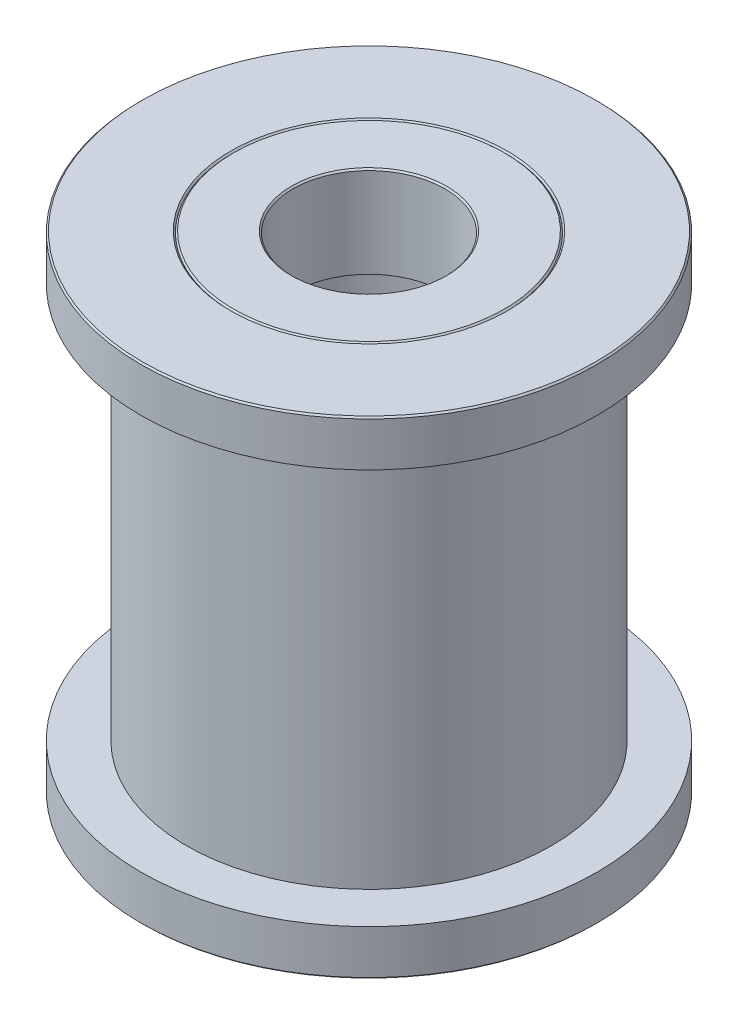
ISO-10303-21;
HEADER;
FILE_DESCRIPTION(('STEP AP214'),'2;1');
FILE_NAME('part.step','',(''),(''),'','','');
FILE_SCHEMA(('AUTOMOTIVE_DESIGN { 1 0 10303 214 1 1 1 1 }'));
ENDSEC;
DATA;
#1=APPLICATION_CONTEXT('core data for automotive mechanical design processes');
#2=APPLICATION_PROTOCOL_DEFINITION('international standard','automotive_design',2000,#1);
#3=PRODUCT_CONTEXT('',#1,'mechanical');
#4=PRODUCT('Part','Part','',(#3));
#5=PRODUCT_RELATED_PRODUCT_CATEGORY('part','',(#4));
#6=PRODUCT_DEFINITION_FORMATION('','',#4);
#7=PRODUCT_DEFINITION_CONTEXT('part definition',#1,'design');
#8=PRODUCT_DEFINITION('design','',#6,#7);
#9=PRODUCT_DEFINITION_SHAPE('','',#8);
#10=(LENGTH_UNIT() NAMED_UNIT(*) SI_UNIT(.MILLI.,.METRE.));
#11=(NAMED_UNIT(*) PLANE_ANGLE_UNIT() SI_UNIT($,.RADIAN.));
#12=(NAMED_UNIT(*) SI_UNIT($,.STERADIAN.) SOLID_ANGLE_UNIT());
#13=UNCERTAINTY_MEASURE_WITH_UNIT(LENGTH_MEASURE(1.E-05),#10,'distance_accuracy_value','');
#14=(GEOMETRIC_REPRESENTATION_CONTEXT(3) GLOBAL_UNCERTAINTY_ASSIGNED_CONTEXT((#13)) GLOBAL_UNIT_ASSIGNED_CONTEXT((#10,
#11,#12)) REPRESENTATION_CONTEXT('',''));
#15=CARTESIAN_POINT('',(0.,0.,0.));
#16=DIRECTION('',(0.,0.,1.));
#17=DIRECTION('',(1.,0.,0.));
#18=AXIS2_PLACEMENT_3D('',#15,#16,#17);
#19=CARTESIAN_POINT('',(0.,-5.57580398162329,0.));
#20=DIRECTION('',(0.,1.,0.));
#21=DIRECTION('',(-1.,0.,0.));
#22=AXIS2_PLACEMENT_3D('',#19,#20,#21);
#23=PLANE('',#22);
#24=CARTESIAN_POINT('',(0.,-5.57580398162329,0.));
#25=DIRECTION('',(0.,-1.,0.));
#26=DIRECTION('',(1.,0.,0.));
#27=AXIS2_PLACEMENT_3D('',#24,#25,#26);
#28=CIRCLE('',#27,2.49999999999996);
#29=CARTESIAN_POINT('',(2.49999999999998,-5.57580398162328,0.));
#30=VERTEX_POINT('',#29);
#31=EDGE_CURVE('E63',#30,#30,#28,.T.);
#32=ORIENTED_EDGE('',*,*,#31,.T.);
#33=EDGE_LOOP('',(#32));
#34=FACE_BOUND('',#33,.T.);
#35=CARTESIAN_POINT('',(0.,-5.57580398162329,0.));
#36=DIRECTION('',(0.,-1.,0.));
#37=DIRECTION('',(1.,0.,0.));
#38=AXIS2_PLACEMENT_3D('',#35,#36,#37);
#39=CIRCLE('',#38,4.49999999999998);
#40=CARTESIAN_POINT('',(4.5,-5.57580398162328,0.));
#41=VERTEX_POINT('',#40);
#42=EDGE_CURVE('E66',#41,#41,#39,.T.);
#43=ORIENTED_EDGE('',*,*,#42,.F.);
#44=EDGE_LOOP('',(#43));
#45=FACE_BOUND('',#44,.T.);
#46=ADVANCED_FACE('F43',(#34,#45),#23,.T.);
#47=CARTESIAN_POINT('',(0.,-12.8882082695253,0.));
#48=DIRECTION('',(0.,-1.,0.));
#49=DIRECTION('',(1.,0.,0.));
#50=AXIS2_PLACEMENT_3D('',#47,#48,#49);
#51=CYLINDRICAL_SURFACE('',#50,2.49999999999995);
#52=CARTESIAN_POINT('',(0.,-8.52580398162329,0.));
#53=DIRECTION('',(0.,1.,0.));
#54=DIRECTION('',(-1.,0.,0.));
#55=AXIS2_PLACEMENT_3D('',#52,#53,#54);
#56=CIRCLE('',#55,2.49999999999995);
#57=CARTESIAN_POINT('',(-2.49999999999992,-8.5258039816233,0.));
#58=VERTEX_POINT('',#57);
#59=EDGE_CURVE('E11',#58,#58,#56,.F.);
#60=ORIENTED_EDGE('',*,*,#59,.T.);
#61=EDGE_LOOP('',(#60));
#62=FACE_BOUND('',#61,.T.);
#63=ORIENTED_EDGE('',*,*,#31,.F.);
#64=EDGE_LOOP('',(#63));
#65=FACE_BOUND('',#64,.T.);
#66=ADVANCED_FACE('F73',(#62,#65),#51,.F.);
#67=CARTESIAN_POINT('',(0.,-8.57580398162329,0.));
#68=DIRECTION('',(0.,1.,0.));
#69=DIRECTION('',(-1.,0.,0.));
#70=AXIS2_PLACEMENT_3D('',#67,#68,#69);
#71=PLANE('',#70);
#72=CARTESIAN_POINT('',(0.,-8.57580398162329,0.));
#73=DIRECTION('',(0.,1.,0.));
#74=DIRECTION('',(-1.,0.,0.));
#75=AXIS2_PLACEMENT_3D('',#72,#73,#74);
#76=CIRCLE('',#75,4.44999999999998);
#77=CARTESIAN_POINT('',(-4.44999999999995,-8.57580398162331,0.));
#78=VERTEX_POINT('',#77);
#79=EDGE_CURVE('E54',#78,#78,#76,.F.);
#80=ORIENTED_EDGE('',*,*,#79,.T.);
#81=EDGE_LOOP('',(#80));
#82=FACE_BOUND('',#81,.T.);
#83=CARTESIAN_POINT('',(0.,-8.57580398162329,0.));
#84=DIRECTION('',(0.,1.,0.));
#85=DIRECTION('',(-1.,0.,0.));
#86=AXIS2_PLACEMENT_3D('',#83,#84,#85);
#87=CIRCLE('',#86,2.54999999999995);
#88=CARTESIAN_POINT('',(-2.54999999999992,-8.5758039816233,0.));
#89=VERTEX_POINT('',#88);
#90=EDGE_CURVE('E58',#89,#89,#87,.T.);
#91=ORIENTED_EDGE('',*,*,#90,.T.);
#92=EDGE_LOOP('',(#91));
#93=FACE_BOUND('',#92,.T.);
#94=ADVANCED_FACE('F79',(#82,#93),#71,.F.);
#95=CARTESIAN_POINT('',(0.,-12.8882082695253,0.));
#96=DIRECTION('',(0.,-1.,0.));
#97=DIRECTION('',(1.,0.,0.));
#98=AXIS2_PLACEMENT_3D('',#95,#96,#97);
#99=CYLINDRICAL_SURFACE('',#98,4.49999999999998);
#100=CARTESIAN_POINT('',(0.,-8.52580398162329,0.));
#101=DIRECTION('',(0.,1.,0.));
#102=DIRECTION('',(-1.,0.,0.));
#103=AXIS2_PLACEMENT_3D('',#100,#101,#102);
#104=CIRCLE('',#103,4.49999999999998);
#105=CARTESIAN_POINT('',(-4.49999999999995,-8.52580398162331,0.));
#106=VERTEX_POINT('',#105);
#107=EDGE_CURVE('E50',#106,#106,#104,.T.);
#108=ORIENTED_EDGE('',*,*,#107,.T.);
#109=EDGE_LOOP('',(#108));
#110=FACE_BOUND('',#109,.T.);
#111=ORIENTED_EDGE('',*,*,#42,.T.);
#112=EDGE_LOOP('',(#111));
#113=FACE_BOUND('',#112,.T.);
#114=ADVANCED_FACE('F70',(#110,#113),#99,.T.);
#115=CARTESIAN_POINT('',(0.,-8.57580398162329,0.));
#116=DIRECTION('',(0.,1.,0.));
#117=DIRECTION('',(-1.,0.,0.));
#118=AXIS2_PLACEMENT_3D('',#115,#116,#117);
#119=CONICAL_SURFACE('',#118,4.44999999999998,0.78539816339744);
#120=ORIENTED_EDGE('',*,*,#107,.F.);
#121=EDGE_LOOP('',(#120));
#122=FACE_BOUND('',#121,.T.);
#123=ORIENTED_EDGE('',*,*,#79,.F.);
#124=EDGE_LOOP('',(#123));
#125=FACE_BOUND('',#124,.T.);
#126=ADVANCED_FACE('F82',(#122,#125),#119,.T.);
#127=CARTESIAN_POINT('',(0.,-8.52580398162329,0.));
#128=DIRECTION('',(0.,-1.,0.));
#129=DIRECTION('',(1.,0.,0.));
#130=AXIS2_PLACEMENT_3D('',#127,#128,#129);
#131=CONICAL_SURFACE('',#130,2.49999999999995,0.785398163397444);
#132=ORIENTED_EDGE('',*,*,#90,.F.);
#133=EDGE_LOOP('',(#132));
#134=FACE_BOUND('',#133,.T.);
#135=ORIENTED_EDGE('',*,*,#59,.F.);
#136=EDGE_LOOP('',(#135));
#137=FACE_BOUND('',#136,.T.);
#138=ADVANCED_FACE('F45',(#134,#137),#131,.F.);
#139=CLOSED_SHELL('',(#46,#66,#94,#114,#126,#138));
#140=MANIFOLD_SOLID_BREP('B2',#139);
#141=CARTESIAN_POINT('',(0.,-12.8882082695253,0.));
#142=DIRECTION('',(0.,-1.,0.));
#143=DIRECTION('',(1.,0.,0.));
#144=AXIS2_PLACEMENT_3D('',#141,#142,#143);
#145=CYLINDRICAL_SURFACE('',#144,2.50000000000002);
#146=CARTESIAN_POINT('',(0.,7.37419601837671,0.));
#147=DIRECTION('',(0.,1.,0.));
#148=DIRECTION('',(-1.,0.,0.));
#149=AXIS2_PLACEMENT_3D('',#146,#147,#148);
#150=CIRCLE('',#149,2.50000000000002);
#151=CARTESIAN_POINT('',(-2.50000000000004,7.3741960183767,0.));
#152=VERTEX_POINT('',#151);
#153=EDGE_CURVE('E42',#152,#152,#150,.T.);
#154=ORIENTED_EDGE('',*,*,#153,.T.);
#155=EDGE_LOOP('',(#154));
#156=FACE_BOUND('',#155,.T.);
#157=CARTESIAN_POINT('',(0.,4.42419601837671,0.));
#158=DIRECTION('',(0.,-1.,0.));
#159=DIRECTION('',(1.,0.,0.));
#160=AXIS2_PLACEMENT_3D('',#157,#158,#159);
#161=CIRCLE('',#160,2.50000000000001);
#162=CARTESIAN_POINT('',(2.5,4.42419601837672,0.));
#163=VERTEX_POINT('',#162);
#164=EDGE_CURVE('E167',#163,#163,#161,.T.);
#165=ORIENTED_EDGE('',*,*,#164,.T.);
#166=EDGE_LOOP('',(#165));
#167=FACE_BOUND('',#166,.T.);
#168=ADVANCED_FACE('F147',(#156,#167),#145,.F.);
#169=CARTESIAN_POINT('',(0.,4.42419601837671,0.));
#170=DIRECTION('',(0.,1.,0.));
#171=DIRECTION('',(-1.,0.,0.));
#172=AXIS2_PLACEMENT_3D('',#169,#170,#171);
#173=PLANE('',#172);
#174=ORIENTED_EDGE('',*,*,#164,.F.);
#175=EDGE_LOOP('',(#174));
#176=FACE_BOUND('',#175,.T.);
#177=CARTESIAN_POINT('',(0.,4.4241960183767,0.));
#178=DIRECTION('',(0.,-1.,0.));
#179=DIRECTION('',(1.,0.,0.));
#180=AXIS2_PLACEMENT_3D('',#177,#178,#179);
#181=CIRCLE('',#180,4.50000000000002);
#182=CARTESIAN_POINT('',(4.5,4.42419601837672,0.));
#183=VERTEX_POINT('',#182);
#184=EDGE_CURVE('E170',#183,#183,#181,.T.);
#185=ORIENTED_EDGE('',*,*,#184,.T.);
#186=EDGE_LOOP('',(#185));
#187=FACE_BOUND('',#186,.T.);
#188=ADVANCED_FACE('F174',(#176,#187),#173,.F.);
#189=CARTESIAN_POINT('',(0.,-12.8882082695253,0.));
#190=DIRECTION('',(0.,-1.,0.));
#191=DIRECTION('',(1.,0.,0.));
#192=AXIS2_PLACEMENT_3D('',#189,#190,#191);
#193=CYLINDRICAL_SURFACE('',#192,4.50000000000002);
#194=CARTESIAN_POINT('',(0.,7.37419601837671,0.));
#195=DIRECTION('',(0.,1.,0.));
#196=DIRECTION('',(-1.,0.,0.));
#197=AXIS2_PLACEMENT_3D('',#194,#195,#196);
#198=CIRCLE('',#197,4.50000000000002);
#199=CARTESIAN_POINT('',(-4.50000000000005,7.3741960183767,0.));
#200=VERTEX_POINT('',#199);
#201=EDGE_CURVE('E162',#200,#200,#198,.F.);
#202=ORIENTED_EDGE('',*,*,#201,.T.);
#203=EDGE_LOOP('',(#202));
#204=FACE_BOUND('',#203,.T.);
#205=ORIENTED_EDGE('',*,*,#184,.F.);
#206=EDGE_LOOP('',(#205));
#207=FACE_BOUND('',#206,.T.);
#208=ADVANCED_FACE('F176',(#204,#207),#193,.T.);
#209=CARTESIAN_POINT('',(0.,7.42419601837671,0.));
#210=DIRECTION('',(0.,1.,0.));
#211=DIRECTION('',(-1.,0.,0.));
#212=AXIS2_PLACEMENT_3D('',#209,#210,#211);
#213=PLANE('',#212);
#214=CARTESIAN_POINT('',(0.,7.42419601837671,0.));
#215=DIRECTION('',(0.,1.,0.));
#216=DIRECTION('',(-1.,0.,0.));
#217=AXIS2_PLACEMENT_3D('',#214,#215,#216);
#218=CIRCLE('',#217,4.45000000000002);
#219=CARTESIAN_POINT('',(-4.45000000000005,7.42419601837669,0.));
#220=VERTEX_POINT('',#219);
#221=EDGE_CURVE('E154',#220,#220,#218,.T.);
#222=ORIENTED_EDGE('',*,*,#221,.T.);
#223=EDGE_LOOP('',(#222));
#224=FACE_BOUND('',#223,.T.);
#225=CARTESIAN_POINT('',(0.,7.42419601837671,0.));
#226=DIRECTION('',(0.,1.,0.));
#227=DIRECTION('',(-1.,0.,0.));
#228=AXIS2_PLACEMENT_3D('',#225,#226,#227);
#229=CIRCLE('',#228,2.55000000000002);
#230=CARTESIAN_POINT('',(-2.55000000000004,7.4241960183767,0.));
#231=VERTEX_POINT('',#230);
#232=EDGE_CURVE('E158',#231,#231,#229,.F.);
#233=ORIENTED_EDGE('',*,*,#232,.T.);
#234=EDGE_LOOP('',(#233));
#235=FACE_BOUND('',#234,.T.);
#236=ADVANCED_FACE('F178',(#224,#235),#213,.T.);
#237=CARTESIAN_POINT('',(0.,7.37419601837671,0.));
#238=DIRECTION('',(0.,-1.,0.));
#239=DIRECTION('',(1.,0.,0.));
#240=AXIS2_PLACEMENT_3D('',#237,#238,#239);
#241=CONICAL_SURFACE('',#240,4.50000000000002,0.785398163397457);
#242=ORIENTED_EDGE('',*,*,#221,.F.);
#243=EDGE_LOOP('',(#242));
#244=FACE_BOUND('',#243,.T.);
#245=ORIENTED_EDGE('',*,*,#201,.F.);
#246=EDGE_LOOP('',(#245));
#247=FACE_BOUND('',#246,.T.);
#248=ADVANCED_FACE('F185',(#244,#247),#241,.T.);
#249=CARTESIAN_POINT('',(0.,7.42419601837671,0.));
#250=DIRECTION('',(0.,1.,0.));
#251=DIRECTION('',(-1.,0.,0.));
#252=AXIS2_PLACEMENT_3D('',#249,#250,#251);
#253=CONICAL_SURFACE('',#252,2.55000000000002,0.785398163397427);
#254=ORIENTED_EDGE('',*,*,#153,.F.);
#255=EDGE_LOOP('',(#254));
#256=FACE_BOUND('',#255,.T.);
#257=ORIENTED_EDGE('',*,*,#232,.F.);
#258=EDGE_LOOP('',(#257));
#259=FACE_BOUND('',#258,.T.);
#260=ADVANCED_FACE('F149',(#256,#259),#253,.F.);
#261=CLOSED_SHELL('',(#168,#188,#208,#236,#248,#260));
#262=MANIFOLD_SOLID_BREP('B6',#261);
#263=CARTESIAN_POINT('',(0.,-12.8882082695253,0.));
#264=DIRECTION('',(0.,-1.,0.));
#265=DIRECTION('',(1.,0.,0.));
#266=AXIS2_PLACEMENT_3D('',#263,#264,#265);
#267=CYLINDRICAL_SURFACE('',#266,4.49999999999998);
#268=CARTESIAN_POINT('',(0.,-8.5258039816233,0.));
#269=DIRECTION('',(0.,-1.,0.));
#270=DIRECTION('',(1.,0.,0.));
#271=AXIS2_PLACEMENT_3D('',#268,#269,#270);
#272=CIRCLE('',#271,4.49999999999998);
#273=CARTESIAN_POINT('',(4.50000000000001,-8.52580398162329,0.));
#274=VERTEX_POINT('',#273);
#275=EDGE_CURVE('E259',#274,#274,#272,.T.);
#276=ORIENTED_EDGE('',*,*,#275,.T.);
#277=EDGE_LOOP('',(#276));
#278=FACE_BOUND('',#277,.T.);
#279=CARTESIAN_POINT('',(0.,-5.57580398162329,0.));
#280=DIRECTION('',(0.,-1.,0.));
#281=DIRECTION('',(1.,0.,0.));
#282=AXIS2_PLACEMENT_3D('',#279,#280,#281);
#283=CIRCLE('',#282,4.49999999999998);
#284=CARTESIAN_POINT('',(4.5,-5.57580398162328,0.));
#285=VERTEX_POINT('',#284);
#286=EDGE_CURVE('E297',#285,#285,#283,.T.);
#287=ORIENTED_EDGE('',*,*,#286,.F.);
#288=EDGE_LOOP('',(#287));
#289=FACE_BOUND('',#288,.T.);
#290=ADVANCED_FACE('F244',(#278,#289),#267,.F.);
#291=CARTESIAN_POINT('',(0.,-8.5758039816233,0.));
#292=DIRECTION('',(0.,-1.,0.));
#293=DIRECTION('',(1.,0.,0.));
#294=AXIS2_PLACEMENT_3D('',#291,#292,#293);
#295=PLANE('',#294);
#296=CARTESIAN_POINT('',(0.,-8.5758039816233,0.));
#297=DIRECTION('',(0.,-1.,0.));
#298=DIRECTION('',(1.,0.,0.));
#299=AXIS2_PLACEMENT_3D('',#296,#297,#298);
#300=CIRCLE('',#299,4.54999999999998);
#301=CARTESIAN_POINT('',(4.55000000000001,-8.57580398162328,0.));
#302=VERTEX_POINT('',#301);
#303=EDGE_CURVE('E251',#302,#302,#300,.F.);
#304=ORIENTED_EDGE('',*,*,#303,.T.);
#305=EDGE_LOOP('',(#304));
#306=FACE_BOUND('',#305,.T.);
#307=CARTESIAN_POINT('',(0.,-8.5758039816233,0.));
#308=DIRECTION('',(0.,-1.,0.));
#309=DIRECTION('',(1.,0.,0.));
#310=AXIS2_PLACEMENT_3D('',#307,#308,#309);
#311=CIRCLE('',#310,7.44999999999998);
#312=CARTESIAN_POINT('',(7.45000000000001,-8.57580398162327,0.));
#313=VERTEX_POINT('',#312);
#314=EDGE_CURVE('E255',#313,#313,#311,.T.);
#315=ORIENTED_EDGE('',*,*,#314,.T.);
#316=EDGE_LOOP('',(#315));
#317=FACE_BOUND('',#316,.T.);
#318=ADVANCED_FACE('F305',(#306,#317),#295,.T.);
#319=CARTESIAN_POINT('',(0.,-12.8882082695253,0.));
#320=DIRECTION('',(0.,-1.,0.));
#321=DIRECTION('',(1.,0.,0.));
#322=AXIS2_PLACEMENT_3D('',#319,#320,#321);
#323=CYLINDRICAL_SURFACE('',#322,7.49999999999997);
#324=CARTESIAN_POINT('',(0.,-8.52580398162331,0.));
#325=DIRECTION('',(0.,-1.,0.));
#326=DIRECTION('',(1.,0.,0.));
#327=AXIS2_PLACEMENT_3D('',#324,#325,#326);
#328=CIRCLE('',#327,7.49999999999997);
#329=CARTESIAN_POINT('',(7.5,-8.52580398162328,0.));
#330=VERTEX_POINT('',#329);
#331=EDGE_CURVE('E146',#330,#330,#328,.F.);
#332=ORIENTED_EDGE('',*,*,#331,.T.);
#333=EDGE_LOOP('',(#332));
#334=FACE_BOUND('',#333,.T.);
#335=CARTESIAN_POINT('',(0.,-7.07580398162331,0.));
#336=DIRECTION('',(0.,-1.,0.));
#337=DIRECTION('',(1.,0.,0.));
#338=AXIS2_PLACEMENT_3D('',#335,#336,#337);
#339=CIRCLE('',#338,7.49999999999997);
#340=CARTESIAN_POINT('',(7.5,-7.07580398162328,0.));
#341=VERTEX_POINT('',#340);
#342=EDGE_CURVE('E276',#341,#341,#339,.T.);
#343=ORIENTED_EDGE('',*,*,#342,.T.);
#344=EDGE_LOOP('',(#343));
#345=FACE_BOUND('',#344,.T.);
#346=ADVANCED_FACE('F311',(#334,#345),#323,.T.);
#347=CARTESIAN_POINT('',(0.,-7.0758039816233,0.));
#348=DIRECTION('',(0.,-1.,0.));
#349=DIRECTION('',(1.,0.,0.));
#350=AXIS2_PLACEMENT_3D('',#347,#348,#349);
#351=PLANE('',#350);
#352=ORIENTED_EDGE('',*,*,#342,.F.);
#353=EDGE_LOOP('',(#352));
#354=FACE_BOUND('',#353,.T.);
#355=CARTESIAN_POINT('',(0.,-7.0758039816233,0.));
#356=DIRECTION('',(0.,-1.,0.));
#357=DIRECTION('',(1.,0.,0.));
#358=AXIS2_PLACEMENT_3D('',#355,#356,#357);
#359=CIRCLE('',#358,5.99999999999998);
#360=CARTESIAN_POINT('',(6.,-7.07580398162328,0.));
#361=VERTEX_POINT('',#360);
#362=EDGE_CURVE('E279',#361,#361,#359,.T.);
#363=ORIENTED_EDGE('',*,*,#362,.T.);
#364=EDGE_LOOP('',(#363));
#365=FACE_BOUND('',#364,.T.);
#366=ADVANCED_FACE('F400',(#354,#365),#351,.F.);
#367=CARTESIAN_POINT('',(0.,-12.8882082695253,0.));
#368=DIRECTION('',(0.,-1.,0.));
#369=DIRECTION('',(1.,0.,0.));
#370=AXIS2_PLACEMENT_3D('',#367,#368,#369);
#371=CYLINDRICAL_SURFACE('',#370,6.);
#372=CARTESIAN_POINT('',(0.,5.9241960183767,0.));
#373=DIRECTION('',(0.,-1.,0.));
#374=DIRECTION('',(1.,0.,0.));
#375=AXIS2_PLACEMENT_3D('',#372,#373,#374);
#376=CIRCLE('',#375,6.00000000000002);
#377=CARTESIAN_POINT('',(6.,5.92419601837672,0.));
#378=VERTEX_POINT('',#377);
#379=EDGE_CURVE('E282',#378,#378,#376,.T.);
#380=ORIENTED_EDGE('',*,*,#379,.T.);
#381=EDGE_LOOP('',(#380));
#382=FACE_BOUND('',#381,.T.);
#383=ORIENTED_EDGE('',*,*,#362,.F.);
#384=EDGE_LOOP('',(#383));
#385=FACE_BOUND('',#384,.T.);
#386=ADVANCED_FACE('F444',(#382,#385),#371,.T.);
#387=CARTESIAN_POINT('',(0.,5.9241960183767,0.));
#388=DIRECTION('',(0.,-1.,0.));
#389=DIRECTION('',(1.,0.,0.));
#390=AXIS2_PLACEMENT_3D('',#387,#388,#389);
#391=PLANE('',#390);
#392=CARTESIAN_POINT('',(0.,5.92419601837669,0.));
#393=DIRECTION('',(0.,-1.,0.));
#394=DIRECTION('',(1.,0.,0.));
#395=AXIS2_PLACEMENT_3D('',#392,#393,#394);
#396=CIRCLE('',#395,7.50000000000002);
#397=CARTESIAN_POINT('',(7.5,5.92419601837672,0.));
#398=VERTEX_POINT('',#397);
#399=EDGE_CURVE('E285',#398,#398,#396,.T.);
#400=ORIENTED_EDGE('',*,*,#399,.T.);
#401=EDGE_LOOP('',(#400));
#402=FACE_BOUND('',#401,.T.);
#403=ORIENTED_EDGE('',*,*,#379,.F.);
#404=EDGE_LOOP('',(#403));
#405=FACE_BOUND('',#404,.T.);
#406=ADVANCED_FACE('F388',(#402,#405),#391,.T.);
#407=CARTESIAN_POINT('',(0.,-12.8882082695253,0.));
#408=DIRECTION('',(0.,-1.,0.));
#409=DIRECTION('',(1.,0.,0.));
#410=AXIS2_PLACEMENT_3D('',#407,#408,#409);
#411=CYLINDRICAL_SURFACE('',#410,7.50000000000002);
#412=CARTESIAN_POINT('',(0.,7.3741960183767,0.));
#413=DIRECTION('',(0.,-1.,0.));
#414=DIRECTION('',(1.,0.,0.));
#415=AXIS2_PLACEMENT_3D('',#412,#413,#414);
#416=CIRCLE('',#415,7.50000000000002);
#417=CARTESIAN_POINT('',(7.5,7.37419601837673,0.));
#418=VERTEX_POINT('',#417);
#419=EDGE_CURVE('E264',#418,#418,#416,.T.);
#420=ORIENTED_EDGE('',*,*,#419,.T.);
#421=EDGE_LOOP('',(#420));
#422=FACE_BOUND('',#421,.T.);
#423=ORIENTED_EDGE('',*,*,#399,.F.);
#424=EDGE_LOOP('',(#423));
#425=FACE_BOUND('',#424,.T.);
#426=ADVANCED_FACE('F378',(#422,#425),#411,.T.);
#427=CARTESIAN_POINT('',(0.,7.4241960183767,0.));
#428=DIRECTION('',(0.,-1.,0.));
#429=DIRECTION('',(1.,0.,0.));
#430=AXIS2_PLACEMENT_3D('',#427,#428,#429);
#431=PLANE('',#430);
#432=CARTESIAN_POINT('',(0.,7.4241960183767,0.));
#433=DIRECTION('',(0.,-1.,0.));
#434=DIRECTION('',(1.,0.,0.));
#435=AXIS2_PLACEMENT_3D('',#432,#433,#434);
#436=CIRCLE('',#435,4.55000000000002);
#437=CARTESIAN_POINT('',(4.55,7.42419601837672,0.));
#438=VERTEX_POINT('',#437);
#439=EDGE_CURVE('E270',#438,#438,#436,.T.);
#440=ORIENTED_EDGE('',*,*,#439,.T.);
#441=EDGE_LOOP('',(#440));
#442=FACE_BOUND('',#441,.T.);
#443=CARTESIAN_POINT('',(0.,7.4241960183767,0.));
#444=DIRECTION('',(0.,-1.,0.));
#445=DIRECTION('',(1.,0.,0.));
#446=AXIS2_PLACEMENT_3D('',#443,#444,#445);
#447=CIRCLE('',#446,7.45000000000002);
#448=CARTESIAN_POINT('',(7.45,7.42419601837673,0.));
#449=VERTEX_POINT('',#448);
#450=EDGE_CURVE('E273',#449,#449,#447,.F.);
#451=ORIENTED_EDGE('',*,*,#450,.T.);
#452=EDGE_LOOP('',(#451));
#453=FACE_BOUND('',#452,.T.);
#454=ADVANCED_FACE('F365',(#442,#453),#431,.F.);
#455=CARTESIAN_POINT('',(0.,-12.8882082695253,0.));
#456=DIRECTION('',(0.,-1.,0.));
#457=DIRECTION('',(1.,0.,0.));
#458=AXIS2_PLACEMENT_3D('',#455,#456,#457);
#459=CYLINDRICAL_SURFACE('',#458,4.50000000000002);
#460=CARTESIAN_POINT('',(0.,7.3741960183767,0.));
#461=DIRECTION('',(0.,-1.,0.));
#462=DIRECTION('',(1.,0.,0.));
#463=AXIS2_PLACEMENT_3D('',#460,#461,#462);
#464=CIRCLE('',#463,4.50000000000002);
#465=CARTESIAN_POINT('',(4.49999999999999,7.37419601837671,0.));
#466=VERTEX_POINT('',#465);
#467=EDGE_CURVE('E267',#466,#466,#464,.F.);
#468=ORIENTED_EDGE('',*,*,#467,.T.);
#469=EDGE_LOOP('',(#468));
#470=FACE_BOUND('',#469,.T.);
#471=CARTESIAN_POINT('',(0.,4.4241960183767,0.));
#472=DIRECTION('',(0.,-1.,0.));
#473=DIRECTION('',(1.,0.,0.));
#474=AXIS2_PLACEMENT_3D('',#471,#472,#473);
#475=CIRCLE('',#474,4.50000000000002);
#476=CARTESIAN_POINT('',(4.5,4.42419601837672,0.));
#477=VERTEX_POINT('',#476);
#478=EDGE_CURVE('E288',#477,#477,#475,.T.);
#479=ORIENTED_EDGE('',*,*,#478,.T.);
#480=EDGE_LOOP('',(#479));
#481=FACE_BOUND('',#480,.T.);
#482=ADVANCED_FACE('F359',(#470,#481),#459,.F.);
#483=CARTESIAN_POINT('',(0.,4.42419601837671,0.));
#484=DIRECTION('',(0.,-1.,0.));
#485=DIRECTION('',(1.,0.,0.));
#486=AXIS2_PLACEMENT_3D('',#483,#484,#485);
#487=PLANE('',#486);
#488=ORIENTED_EDGE('',*,*,#478,.F.);
#489=EDGE_LOOP('',(#488));
#490=FACE_BOUND('',#489,.T.);
#491=CARTESIAN_POINT('',(0.,4.42419601837671,0.));
#492=DIRECTION('',(0.,-1.,0.));
#493=DIRECTION('',(1.,0.,0.));
#494=AXIS2_PLACEMENT_3D('',#491,#492,#493);
#495=CIRCLE('',#494,3.50000000000002);
#496=CARTESIAN_POINT('',(3.5,4.42419601837672,0.));
#497=VERTEX_POINT('',#496);
#498=EDGE_CURVE('E291',#497,#497,#495,.T.);
#499=ORIENTED_EDGE('',*,*,#498,.T.);
#500=EDGE_LOOP('',(#499));
#501=FACE_BOUND('',#500,.T.);
#502=ADVANCED_FACE('F364',(#490,#501),#487,.F.);
#503=CARTESIAN_POINT('',(0.,-12.8882082695253,0.));
#504=DIRECTION('',(0.,-1.,0.));
#505=DIRECTION('',(1.,0.,0.));
#506=AXIS2_PLACEMENT_3D('',#503,#504,#505);
#507=CYLINDRICAL_SURFACE('',#506,3.5);
#508=ORIENTED_EDGE('',*,*,#498,.F.);
#509=EDGE_LOOP('',(#508));
#510=FACE_BOUND('',#509,.T.);
#511=CARTESIAN_POINT('',(0.,-5.57580398162329,0.));
#512=DIRECTION('',(0.,-1.,0.));
#513=DIRECTION('',(1.,0.,0.));
#514=AXIS2_PLACEMENT_3D('',#511,#512,#513);
#515=CIRCLE('',#514,3.49999999999998);
#516=CARTESIAN_POINT('',(3.5,-5.57580398162328,0.));
#517=VERTEX_POINT('',#516);
#518=EDGE_CURVE('E294',#517,#517,#515,.T.);
#519=ORIENTED_EDGE('',*,*,#518,.T.);
#520=EDGE_LOOP('',(#519));
#521=FACE_BOUND('',#520,.T.);
#522=ADVANCED_FACE('F419',(#510,#521),#507,.F.);
#523=CARTESIAN_POINT('',(0.,-5.57580398162329,0.));
#524=DIRECTION('',(0.,-1.,0.));
#525=DIRECTION('',(1.,0.,0.));
#526=AXIS2_PLACEMENT_3D('',#523,#524,#525);
#527=PLANE('',#526);
#528=ORIENTED_EDGE('',*,*,#286,.T.);
#529=EDGE_LOOP('',(#528));
#530=FACE_BOUND('',#529,.T.);
#531=ORIENTED_EDGE('',*,*,#518,.F.);
#532=EDGE_LOOP('',(#531));
#533=FACE_BOUND('',#532,.T.);
#534=ADVANCED_FACE('F301',(#530,#533),#527,.T.);
#535=CARTESIAN_POINT('',(0.,7.4241960183767,0.));
#536=DIRECTION('',(0.,1.,0.));
#537=DIRECTION('',(-1.,0.,0.));
#538=AXIS2_PLACEMENT_3D('',#535,#536,#537);
#539=CONICAL_SURFACE('',#538,4.55000000000002,0.785398163397457);
#540=ORIENTED_EDGE('',*,*,#467,.F.);
#541=EDGE_LOOP('',(#540));
#542=FACE_BOUND('',#541,.T.);
#543=ORIENTED_EDGE('',*,*,#439,.F.);
#544=EDGE_LOOP('',(#543));
#545=FACE_BOUND('',#544,.T.);
#546=ADVANCED_FACE('F315',(#542,#545),#539,.F.);
#547=CARTESIAN_POINT('',(0.,7.3741960183767,0.));
#548=DIRECTION('',(0.,-1.,0.));
#549=DIRECTION('',(1.,0.,0.));
#550=AXIS2_PLACEMENT_3D('',#547,#548,#549);
#551=CONICAL_SURFACE('',#550,7.50000000000002,0.785398163397431);
#552=ORIENTED_EDGE('',*,*,#450,.F.);
#553=EDGE_LOOP('',(#552));
#554=FACE_BOUND('',#553,.T.);
#555=ORIENTED_EDGE('',*,*,#419,.F.);
#556=EDGE_LOOP('',(#555));
#557=FACE_BOUND('',#556,.T.);
#558=ADVANCED_FACE('F318',(#554,#557),#551,.T.);
#559=CARTESIAN_POINT('',(0.,-8.5258039816233,0.));
#560=DIRECTION('',(0.,-1.,0.));
#561=DIRECTION('',(1.,0.,0.));
#562=AXIS2_PLACEMENT_3D('',#559,#560,#561);
#563=CONICAL_SURFACE('',#562,4.49999999999998,0.785398163397474);
#564=ORIENTED_EDGE('',*,*,#303,.F.);
#565=EDGE_LOOP('',(#564));
#566=FACE_BOUND('',#565,.T.);
#567=ORIENTED_EDGE('',*,*,#275,.F.);
#568=EDGE_LOOP('',(#567));
#569=FACE_BOUND('',#568,.T.);
#570=ADVANCED_FACE('F321',(#566,#569),#563,.F.);
#571=CARTESIAN_POINT('',(0.,-8.5758039816233,0.));
#572=DIRECTION('',(0.,1.,0.));
#573=DIRECTION('',(-1.,0.,0.));
#574=AXIS2_PLACEMENT_3D('',#571,#572,#573);
#575=CONICAL_SURFACE('',#574,7.44999999999998,0.785398163397483);
#576=ORIENTED_EDGE('',*,*,#331,.F.);
#577=EDGE_LOOP('',(#576));
#578=FACE_BOUND('',#577,.T.);
#579=ORIENTED_EDGE('',*,*,#314,.F.);
#580=EDGE_LOOP('',(#579));
#581=FACE_BOUND('',#580,.T.);
#582=ADVANCED_FACE('F246',(#578,#581),#575,.T.);
#583=CLOSED_SHELL('',(#290,#318,#346,#366,#386,#406,#426,#454,#482,#502,#522,#534,#546,#558,
#570,#582));
#584=MANIFOLD_SOLID_BREP('B37',#583);
#585=ADVANCED_BREP_SHAPE_REPRESENTATION('',(#18,#140,#262,#584),#14);
#586=SHAPE_DEFINITION_REPRESENTATION(#9,#585);
ENDSEC;
END-ISO-10303-21;
